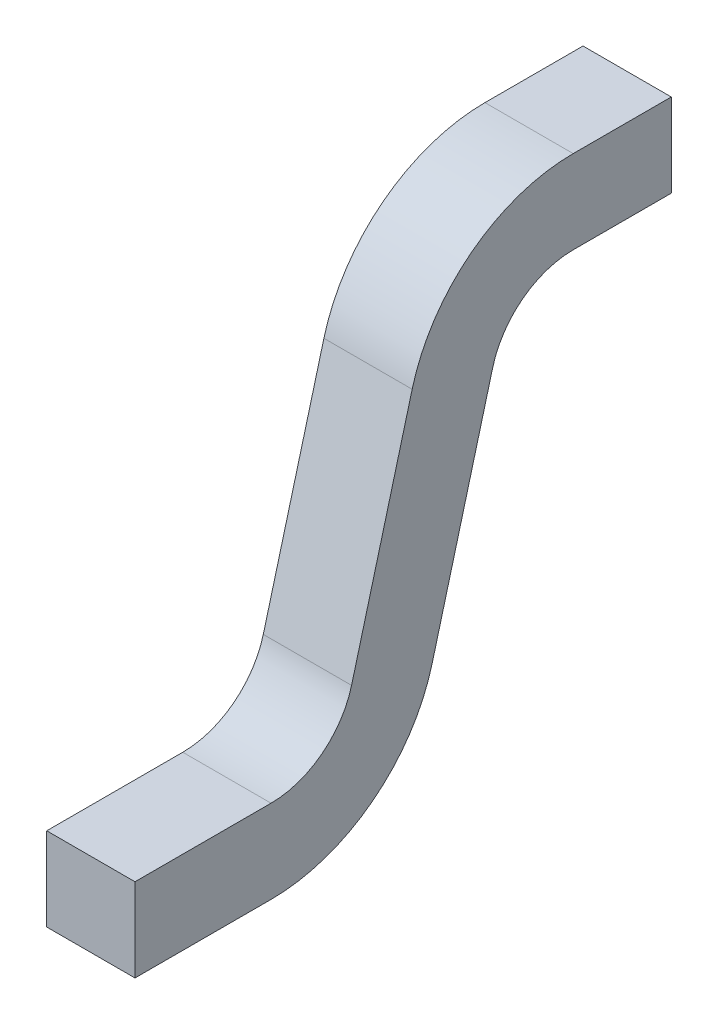
ISO-10303-21;
HEADER;
FILE_DESCRIPTION(('STEP AP214'),'2;1');
FILE_NAME('part.step','',(''),(''),'','','');
FILE_SCHEMA(('AUTOMOTIVE_DESIGN { 1 0 10303 214 1 1 1 1 }'));
ENDSEC;
DATA;
#1=APPLICATION_CONTEXT('core data for automotive mechanical design processes');
#2=APPLICATION_PROTOCOL_DEFINITION('international standard','automotive_design',2000,#1);
#3=PRODUCT_CONTEXT('',#1,'mechanical');
#4=PRODUCT('Part','Part','',(#3));
#5=PRODUCT_RELATED_PRODUCT_CATEGORY('part','',(#4));
#6=PRODUCT_DEFINITION_FORMATION('','',#4);
#7=PRODUCT_DEFINITION_CONTEXT('part definition',#1,'design');
#8=PRODUCT_DEFINITION('design','',#6,#7);
#9=PRODUCT_DEFINITION_SHAPE('','',#8);
#10=(LENGTH_UNIT() NAMED_UNIT(*) SI_UNIT(.MILLI.,.METRE.));
#11=(NAMED_UNIT(*) PLANE_ANGLE_UNIT() SI_UNIT($,.RADIAN.));
#12=(NAMED_UNIT(*) SI_UNIT($,.STERADIAN.) SOLID_ANGLE_UNIT());
#13=UNCERTAINTY_MEASURE_WITH_UNIT(LENGTH_MEASURE(1.E-05),#10,'distance_accuracy_value','');
#14=(GEOMETRIC_REPRESENTATION_CONTEXT(3) GLOBAL_UNCERTAINTY_ASSIGNED_CONTEXT((#13)) GLOBAL_UNIT_ASSIGNED_CONTEXT((#10,
#11,#12)) REPRESENTATION_CONTEXT('',''));
#15=CARTESIAN_POINT('',(0.,0.,0.));
#16=DIRECTION('',(0.,0.,1.));
#17=DIRECTION('',(1.,0.,0.));
#18=AXIS2_PLACEMENT_3D('',#15,#16,#17);
#19=CARTESIAN_POINT('',(-0.0900000000000001,-0.839203393915477,-0.306328844074898));
#20=DIRECTION('',(-1.,0.,0.));
#21=DIRECTION('',(0.,0.,1.));
#22=AXIS2_PLACEMENT_3D('',#19,#20,#21);
#23=PLANE('',#22);
#24=DIRECTION('',(0.,0.,-1.));
#25=VECTOR('',#24,1.);
#26=CARTESIAN_POINT('',(-0.0899999999999999,0.,0.7));
#27=LINE('',#26,#25);
#28=CARTESIAN_POINT('',(-0.0899999999999999,0.,0.2));
#29=VERTEX_POINT('',#28);
#30=CARTESIAN_POINT('',(-0.09,0.,0.));
#31=VERTEX_POINT('',#30);
#32=EDGE_CURVE('E130',#29,#31,#27,.T.);
#33=ORIENTED_EDGE('',*,*,#32,.F.);
#34=CARTESIAN_POINT('',(-0.0899999999999999,-0.17,0.2));
#35=DIRECTION('',(1.,0.,0.));
#36=DIRECTION('',(0.,0.,-1.));
#37=AXIS2_PLACEMENT_3D('',#34,#35,#36);
#38=CIRCLE('',#37,0.17);
#39=CARTESIAN_POINT('',(-0.0899999999999997,-0.126000762332571,0.364207390469142));
#40=VERTEX_POINT('',#39);
#41=EDGE_CURVE('E139',#29,#40,#38,.T.);
#42=ORIENTED_EDGE('',*,*,#41,.T.);
#43=DIRECTION('',(0.,0.965925826289068,-0.258819045102521));
#44=VECTOR('',#43,1.);
#45=CARTESIAN_POINT('',(-0.0899999999999996,-0.39401670399252,0.436022045595592));
#46=LINE('',#45,#44);
#47=CARTESIAN_POINT('',(-0.0899999999999995,-0.587201869250333,0.487785854616096));
#48=VERTEX_POINT('',#47);
#49=EDGE_CURVE('E136',#48,#40,#46,.T.);
#50=ORIENTED_EDGE('',*,*,#49,.F.);
#51=CARTESIAN_POINT('',(-0.0899999999999994,-0.499203393915476,0.816200635554379));
#52=DIRECTION('',(-1.,0.,0.));
#53=DIRECTION('',(0.,-1.,0.));
#54=AXIS2_PLACEMENT_3D('',#51,#52,#53);
#55=CIRCLE('',#54,0.34);
#56=CARTESIAN_POINT('',(-0.0899999999999995,-0.839203393915476,0.816200635554379));
#57=VERTEX_POINT('',#56);
#58=EDGE_CURVE('E171',#57,#48,#55,.F.);
#59=ORIENTED_EDGE('',*,*,#58,.F.);
#60=DIRECTION('',(0.,0.,-1.));
#61=VECTOR('',#60,1.);
#62=CARTESIAN_POINT('',(-0.0899999999999994,-0.839203393915477,0.393671155925102));
#63=LINE('',#62,#61);
#64=CARTESIAN_POINT('',(-0.0899999999999994,-0.839203393915476,1.0936711559251));
#65=VERTEX_POINT('',#64);
#66=EDGE_CURVE('E141',#65,#57,#63,.T.);
#67=ORIENTED_EDGE('',*,*,#66,.F.);
#68=DIRECTION('',(0.,-1.,0.));
#69=VECTOR('',#68,1.);
#70=CARTESIAN_POINT('',(-0.0899999999999994,-0.839203393915476,1.0936711559251));
#71=LINE('',#70,#69);
#72=CARTESIAN_POINT('',(-0.0899999999999994,-0.669203393915476,1.0936711559251));
#73=VERTEX_POINT('',#72);
#74=EDGE_CURVE('E147',#73,#65,#71,.T.);
#75=ORIENTED_EDGE('',*,*,#74,.F.);
#76=DIRECTION('',(0.,0.,1.));
#77=VECTOR('',#76,1.);
#78=CARTESIAN_POINT('',(-0.0899999999999995,-0.669203393915477,0.393671155925102));
#79=LINE('',#78,#77);
#80=CARTESIAN_POINT('',(-0.0899999999999995,-0.669203393915477,0.816200635554379));
#81=VERTEX_POINT('',#80);
#82=EDGE_CURVE('E100',#81,#73,#79,.T.);
#83=ORIENTED_EDGE('',*,*,#82,.F.);
#84=CARTESIAN_POINT('',(-0.0899999999999995,-0.499203393915476,0.816200635554379));
#85=DIRECTION('',(-1.,0.,0.));
#86=DIRECTION('',(0.,-1.,0.));
#87=AXIS2_PLACEMENT_3D('',#84,#85,#86);
#88=CIRCLE('',#87,0.17);
#89=CARTESIAN_POINT('',(-0.0899999999999996,-0.543202631582905,0.651993245085237));
#90=VERTEX_POINT('',#89);
#91=EDGE_CURVE('E20',#81,#90,#88,.F.);
#92=ORIENTED_EDGE('',*,*,#91,.T.);
#93=DIRECTION('',(0.,-0.965925826289068,0.258819045102521));
#94=VECTOR('',#93,1.);
#95=CARTESIAN_POINT('',(-0.0899999999999997,-0.350017466325091,0.600229436064733));
#96=LINE('',#95,#94);
#97=CARTESIAN_POINT('',(-0.0899999999999998,-0.0820015246651428,0.528414780938283));
#98=VERTEX_POINT('',#97);
#99=EDGE_CURVE('E97',#98,#90,#96,.T.);
#100=ORIENTED_EDGE('',*,*,#99,.F.);
#101=CARTESIAN_POINT('',(-0.0899999999999999,-0.17,0.2));
#102=DIRECTION('',(1.,0.,0.));
#103=DIRECTION('',(0.,0.,-1.));
#104=AXIS2_PLACEMENT_3D('',#101,#102,#103);
#105=CIRCLE('',#104,0.34);
#106=CARTESIAN_POINT('',(-0.0899999999999999,0.17,0.2));
#107=VERTEX_POINT('',#106);
#108=EDGE_CURVE('E168',#107,#98,#105,.T.);
#109=ORIENTED_EDGE('',*,*,#108,.F.);
#110=DIRECTION('',(0.,0.,1.));
#111=VECTOR('',#110,1.);
#112=CARTESIAN_POINT('',(-0.09,0.17,0.7));
#113=LINE('',#112,#111);
#114=CARTESIAN_POINT('',(-0.09,0.17,0.));
#115=VERTEX_POINT('',#114);
#116=EDGE_CURVE('E119',#115,#107,#113,.T.);
#117=ORIENTED_EDGE('',*,*,#116,.F.);
#118=DIRECTION('',(0.,1.,0.));
#119=VECTOR('',#118,1.);
#120=CARTESIAN_POINT('',(-0.09,0.,0.));
#121=LINE('',#120,#119);
#122=EDGE_CURVE('E124',#31,#115,#121,.T.);
#123=ORIENTED_EDGE('',*,*,#122,.F.);
#124=EDGE_LOOP('',(#33,#42,#50,#59,#67,#75,#83,#92,#100,#109,#117,#123));
#125=FACE_BOUND('',#124,.T.);
#126=ADVANCED_FACE('F17',(#125),#23,.T.);
#127=CARTESIAN_POINT('',(0.,-0.350017466325091,0.600229436064733));
#128=DIRECTION('',(0.,0.258819045102521,0.965925826289068));
#129=DIRECTION('',(0.,-0.965925826289068,0.258819045102521));
#130=AXIS2_PLACEMENT_3D('',#127,#128,#129);
#131=PLANE('',#130);
#132=DIRECTION('',(-1.,0.,0.));
#133=VECTOR('',#132,1.);
#134=CARTESIAN_POINT('',(-0.267707469156736,-0.543202631582905,0.651993245085238));
#135=LINE('',#134,#133);
#136=CARTESIAN_POINT('',(0.0900000000000002,-0.543202631582905,0.651993245085238));
#137=VERTEX_POINT('',#136);
#138=EDGE_CURVE('E102',#90,#137,#135,.F.);
#139=ORIENTED_EDGE('',*,*,#138,.T.);
#140=DIRECTION('',(0.,-0.965925826289068,0.258819045102522));
#141=VECTOR('',#140,1.);
#142=CARTESIAN_POINT('',(0.0900000000000002,-0.0820015246651429,0.528414780938283));
#143=LINE('',#142,#141);
#144=CARTESIAN_POINT('',(0.0900000000000001,-0.0820015246651426,0.528414780938283));
#145=VERTEX_POINT('',#144);
#146=EDGE_CURVE('E167',#145,#137,#143,.T.);
#147=ORIENTED_EDGE('',*,*,#146,.F.);
#148=DIRECTION('',(1.,0.,0.));
#149=VECTOR('',#148,1.);
#150=CARTESIAN_POINT('',(0.194661618624334,-0.0820015246651427,0.528414780938283));
#151=LINE('',#150,#149);
#152=EDGE_CURVE('E107',#98,#145,#151,.T.);
#153=ORIENTED_EDGE('',*,*,#152,.F.);
#154=ORIENTED_EDGE('',*,*,#99,.T.);
#155=EDGE_LOOP('',(#139,#147,#153,#154));
#156=FACE_BOUND('',#155,.T.);
#157=ADVANCED_FACE('F104',(#156),#131,.T.);
#158=CARTESIAN_POINT('',(-0.267707469156736,-0.499203393915476,0.816200635554379));
#159=DIRECTION('',(-1.,0.,0.));
#160=DIRECTION('',(0.,-1.,0.));
#161=AXIS2_PLACEMENT_3D('',#158,#159,#160);
#162=CYLINDRICAL_SURFACE('',#161,0.17);
#163=CARTESIAN_POINT('',(0.0900000000000002,-0.499203393915476,0.816200635554379));
#164=DIRECTION('',(-1.,0.,0.));
#165=DIRECTION('',(0.,-1.,0.));
#166=AXIS2_PLACEMENT_3D('',#163,#164,#165);
#167=CIRCLE('',#166,0.17);
#168=CARTESIAN_POINT('',(0.0900000000000002,-0.669203393915476,0.816200635554379));
#169=VERTEX_POINT('',#168);
#170=EDGE_CURVE('E112',#137,#169,#167,.T.);
#171=ORIENTED_EDGE('',*,*,#170,.F.);
#172=ORIENTED_EDGE('',*,*,#138,.F.);
#173=ORIENTED_EDGE('',*,*,#91,.F.);
#174=DIRECTION('',(1.,0.,0.));
#175=VECTOR('',#174,1.);
#176=CARTESIAN_POINT('',(0.,-0.669203393915477,0.816200635554379));
#177=LINE('',#176,#175);
#178=EDGE_CURVE('E114',#169,#81,#177,.F.);
#179=ORIENTED_EDGE('',*,*,#178,.F.);
#180=EDGE_LOOP('',(#171,#172,#173,#179));
#181=FACE_BOUND('',#180,.T.);
#182=ADVANCED_FACE('F110',(#181),#162,.F.);
#183=CARTESIAN_POINT('',(0.,-0.669203393915477,0.393671155925102));
#184=DIRECTION('',(0.,1.,0.));
#185=DIRECTION('',(0.,0.,1.));
#186=AXIS2_PLACEMENT_3D('',#183,#184,#185);
#187=PLANE('',#186);
#188=DIRECTION('',(1.,0.,0.));
#189=VECTOR('',#188,1.);
#190=CARTESIAN_POINT('',(-0.0899999999999994,-0.669203393915476,1.0936711559251));
#191=LINE('',#190,#189);
#192=CARTESIAN_POINT('',(0.0900000000000003,-0.669203393915476,1.0936711559251));
#193=VERTEX_POINT('',#192);
#194=EDGE_CURVE('E150',#193,#73,#191,.F.);
#195=ORIENTED_EDGE('',*,*,#194,.F.);
#196=DIRECTION('',(0.,0.,-1.));
#197=VECTOR('',#196,1.);
#198=CARTESIAN_POINT('',(0.0900000000000003,-0.669203393915476,1.0936711559251));
#199=LINE('',#198,#197);
#200=EDGE_CURVE('E166',#169,#193,#199,.F.);
#201=ORIENTED_EDGE('',*,*,#200,.F.);
#202=ORIENTED_EDGE('',*,*,#178,.T.);
#203=ORIENTED_EDGE('',*,*,#82,.T.);
#204=EDGE_LOOP('',(#195,#201,#202,#203));
#205=FACE_BOUND('',#204,.T.);
#206=ADVANCED_FACE('F202',(#205),#187,.T.);
#207=CARTESIAN_POINT('',(-0.0899999999999994,-0.839203393915476,1.0936711559251));
#208=DIRECTION('',(0.,0.,1.));
#209=DIRECTION('',(0.,-1.,0.));
#210=AXIS2_PLACEMENT_3D('',#207,#208,#209);
#211=PLANE('',#210);
#212=ORIENTED_EDGE('',*,*,#194,.T.);
#213=ORIENTED_EDGE('',*,*,#74,.T.);
#214=DIRECTION('',(1.,0.,0.));
#215=VECTOR('',#214,1.);
#216=CARTESIAN_POINT('',(0.,-0.839203393915477,1.0936711559251));
#217=LINE('',#216,#215);
#218=CARTESIAN_POINT('',(0.0900000000000003,-0.839203393915476,1.0936711559251));
#219=VERTEX_POINT('',#218);
#220=EDGE_CURVE('E144',#219,#65,#217,.F.);
#221=ORIENTED_EDGE('',*,*,#220,.F.);
#222=DIRECTION('',(0.,1.,0.));
#223=VECTOR('',#222,1.);
#224=CARTESIAN_POINT('',(0.0900000000000003,-0.839203393915476,1.0936711559251));
#225=LINE('',#224,#223);
#226=EDGE_CURVE('E186',#193,#219,#225,.F.);
#227=ORIENTED_EDGE('',*,*,#226,.F.);
#228=EDGE_LOOP('',(#212,#213,#221,#227));
#229=FACE_BOUND('',#228,.T.);
#230=ADVANCED_FACE('F196',(#229),#211,.T.);
#231=CARTESIAN_POINT('',(0.,-0.839203393915477,0.393671155925102));
#232=DIRECTION('',(0.,-1.,0.));
#233=DIRECTION('',(0.,0.,-1.));
#234=AXIS2_PLACEMENT_3D('',#231,#232,#233);
#235=PLANE('',#234);
#236=ORIENTED_EDGE('',*,*,#220,.T.);
#237=ORIENTED_EDGE('',*,*,#66,.T.);
#238=DIRECTION('',(-1.,0.,0.));
#239=VECTOR('',#238,1.);
#240=CARTESIAN_POINT('',(-0.267707469156736,-0.839203393915476,0.816200635554379));
#241=LINE('',#240,#239);
#242=CARTESIAN_POINT('',(0.0900000000000002,-0.839203393915476,0.816200635554379));
#243=VERTEX_POINT('',#242);
#244=EDGE_CURVE('E143',#243,#57,#241,.T.);
#245=ORIENTED_EDGE('',*,*,#244,.F.);
#246=DIRECTION('',(0.,0.,-1.));
#247=VECTOR('',#246,1.);
#248=CARTESIAN_POINT('',(0.0900000000000003,-0.839203393915476,1.0936711559251));
#249=LINE('',#248,#247);
#250=EDGE_CURVE('E164',#219,#243,#249,.T.);
#251=ORIENTED_EDGE('',*,*,#250,.F.);
#252=EDGE_LOOP('',(#236,#237,#245,#251));
#253=FACE_BOUND('',#252,.T.);
#254=ADVANCED_FACE('F267',(#253),#235,.T.);
#255=CARTESIAN_POINT('',(-0.267707469156736,-0.499203393915476,0.816200635554379));
#256=DIRECTION('',(-1.,0.,0.));
#257=DIRECTION('',(0.,-1.,0.));
#258=AXIS2_PLACEMENT_3D('',#255,#256,#257);
#259=CYLINDRICAL_SURFACE('',#258,0.34);
#260=DIRECTION('',(1.,0.,0.));
#261=VECTOR('',#260,1.);
#262=CARTESIAN_POINT('',(0.,-0.587201869250334,0.487785854616096));
#263=LINE('',#262,#261);
#264=CARTESIAN_POINT('',(0.0900000000000001,-0.587201869250333,0.487785854616096));
#265=VERTEX_POINT('',#264);
#266=EDGE_CURVE('E140',#265,#48,#263,.F.);
#267=ORIENTED_EDGE('',*,*,#266,.F.);
#268=CARTESIAN_POINT('',(0.0900000000000002,-0.499203393915476,0.816200635554379));
#269=DIRECTION('',(-1.,0.,0.));
#270=DIRECTION('',(0.,-1.,0.));
#271=AXIS2_PLACEMENT_3D('',#268,#269,#270);
#272=CIRCLE('',#271,0.34);
#273=EDGE_CURVE('E161',#243,#265,#272,.F.);
#274=ORIENTED_EDGE('',*,*,#273,.F.);
#275=ORIENTED_EDGE('',*,*,#244,.T.);
#276=ORIENTED_EDGE('',*,*,#58,.T.);
#277=EDGE_LOOP('',(#267,#274,#275,#276));
#278=FACE_BOUND('',#277,.T.);
#279=ADVANCED_FACE('F264',(#278),#259,.T.);
#280=CARTESIAN_POINT('',(0.,-0.39401670399252,0.436022045595592));
#281=DIRECTION('',(0.,-0.258819045102521,-0.965925826289068));
#282=DIRECTION('',(0.,0.965925826289068,-0.258819045102521));
#283=AXIS2_PLACEMENT_3D('',#280,#281,#282);
#284=PLANE('',#283);
#285=ORIENTED_EDGE('',*,*,#266,.T.);
#286=ORIENTED_EDGE('',*,*,#49,.T.);
#287=DIRECTION('',(1.,0.,0.));
#288=VECTOR('',#287,1.);
#289=CARTESIAN_POINT('',(0.194661618624334,-0.126000762332571,0.364207390469142));
#290=LINE('',#289,#288);
#291=CARTESIAN_POINT('',(0.0900000000000001,-0.126000762332571,0.364207390469142));
#292=VERTEX_POINT('',#291);
#293=EDGE_CURVE('E170',#40,#292,#290,.T.);
#294=ORIENTED_EDGE('',*,*,#293,.T.);
#295=DIRECTION('',(0.,0.965925826289068,-0.25881904510252));
#296=VECTOR('',#295,1.);
#297=CARTESIAN_POINT('',(0.0900000000000001,-0.587201869250334,0.487785854616096));
#298=LINE('',#297,#296);
#299=EDGE_CURVE('E160',#265,#292,#298,.T.);
#300=ORIENTED_EDGE('',*,*,#299,.F.);
#301=EDGE_LOOP('',(#285,#286,#294,#300));
#302=FACE_BOUND('',#301,.T.);
#303=ADVANCED_FACE('F237',(#302),#284,.T.);
#304=CARTESIAN_POINT('',(0.194661618624334,-0.17,0.2));
#305=DIRECTION('',(1.,0.,0.));
#306=DIRECTION('',(0.,0.,-1.));
#307=AXIS2_PLACEMENT_3D('',#304,#305,#306);
#308=CYLINDRICAL_SURFACE('',#307,0.17);
#309=ORIENTED_EDGE('',*,*,#41,.F.);
#310=DIRECTION('',(1.,0.,0.));
#311=VECTOR('',#310,1.);
#312=CARTESIAN_POINT('',(0.,0.,0.2));
#313=LINE('',#312,#311);
#314=CARTESIAN_POINT('',(0.0900000000000001,0.,0.2));
#315=VERTEX_POINT('',#314);
#316=EDGE_CURVE('E133',#315,#29,#313,.F.);
#317=ORIENTED_EDGE('',*,*,#316,.F.);
#318=CARTESIAN_POINT('',(0.0900000000000001,-0.17,0.2));
#319=DIRECTION('',(1.,0.,0.));
#320=DIRECTION('',(0.,0.,-1.));
#321=AXIS2_PLACEMENT_3D('',#318,#319,#320);
#322=CIRCLE('',#321,0.17);
#323=EDGE_CURVE('E156',#292,#315,#322,.F.);
#324=ORIENTED_EDGE('',*,*,#323,.F.);
#325=ORIENTED_EDGE('',*,*,#293,.F.);
#326=EDGE_LOOP('',(#309,#317,#324,#325));
#327=FACE_BOUND('',#326,.T.);
#328=ADVANCED_FACE('F240',(#327),#308,.F.);
#329=CARTESIAN_POINT('',(0.,0.,0.7));
#330=DIRECTION('',(0.,-1.,0.));
#331=DIRECTION('',(0.,0.,-1.));
#332=AXIS2_PLACEMENT_3D('',#329,#330,#331);
#333=PLANE('',#332);
#334=DIRECTION('',(-1.,0.,0.));
#335=VECTOR('',#334,1.);
#336=CARTESIAN_POINT('',(0.09,0.,0.));
#337=LINE('',#336,#335);
#338=CARTESIAN_POINT('',(0.0900000000000001,0.,0.));
#339=VERTEX_POINT('',#338);
#340=EDGE_CURVE('E127',#339,#31,#337,.T.);
#341=ORIENTED_EDGE('',*,*,#340,.F.);
#342=DIRECTION('',(0.,0.,-1.));
#343=VECTOR('',#342,1.);
#344=CARTESIAN_POINT('',(0.0900000000000004,0.,1.0936711559251));
#345=LINE('',#344,#343);
#346=EDGE_CURVE('E159',#315,#339,#345,.T.);
#347=ORIENTED_EDGE('',*,*,#346,.F.);
#348=ORIENTED_EDGE('',*,*,#316,.T.);
#349=ORIENTED_EDGE('',*,*,#32,.T.);
#350=EDGE_LOOP('',(#341,#347,#348,#349));
#351=FACE_BOUND('',#350,.T.);
#352=ADVANCED_FACE('F263',(#351),#333,.T.);
#353=CARTESIAN_POINT('',(0.09,0.,0.));
#354=DIRECTION('',(0.,0.,-1.));
#355=DIRECTION('',(-1.,0.,0.));
#356=AXIS2_PLACEMENT_3D('',#353,#354,#355);
#357=PLANE('',#356);
#358=DIRECTION('',(1.,0.,0.));
#359=VECTOR('',#358,1.);
#360=CARTESIAN_POINT('',(0.,0.17,0.));
#361=LINE('',#360,#359);
#362=CARTESIAN_POINT('',(0.0900000000000001,0.17,0.));
#363=VERTEX_POINT('',#362);
#364=EDGE_CURVE('E121',#363,#115,#361,.F.);
#365=ORIENTED_EDGE('',*,*,#364,.F.);
#366=DIRECTION('',(0.,1.,0.));
#367=VECTOR('',#366,1.);
#368=CARTESIAN_POINT('',(0.09,-0.839203393915476,0.));
#369=LINE('',#368,#367);
#370=EDGE_CURVE('E225',#339,#363,#369,.T.);
#371=ORIENTED_EDGE('',*,*,#370,.F.);
#372=ORIENTED_EDGE('',*,*,#340,.T.);
#373=ORIENTED_EDGE('',*,*,#122,.T.);
#374=EDGE_LOOP('',(#365,#371,#372,#373));
#375=FACE_BOUND('',#374,.T.);
#376=ADVANCED_FACE('F213',(#375),#357,.T.);
#377=CARTESIAN_POINT('',(0.,0.17,0.7));
#378=DIRECTION('',(0.,1.,0.));
#379=DIRECTION('',(0.,0.,1.));
#380=AXIS2_PLACEMENT_3D('',#377,#378,#379);
#381=PLANE('',#380);
#382=ORIENTED_EDGE('',*,*,#364,.T.);
#383=ORIENTED_EDGE('',*,*,#116,.T.);
#384=DIRECTION('',(1.,0.,0.));
#385=VECTOR('',#384,1.);
#386=CARTESIAN_POINT('',(0.194661618624334,0.17,0.2));
#387=LINE('',#386,#385);
#388=CARTESIAN_POINT('',(0.0900000000000001,0.17,0.2));
#389=VERTEX_POINT('',#388);
#390=EDGE_CURVE('E35',#389,#107,#387,.F.);
#391=ORIENTED_EDGE('',*,*,#390,.F.);
#392=DIRECTION('',(0.,0.,-1.));
#393=VECTOR('',#392,1.);
#394=CARTESIAN_POINT('',(0.0900000000000004,0.17,1.0936711559251));
#395=LINE('',#394,#393);
#396=EDGE_CURVE('E26',#363,#389,#395,.F.);
#397=ORIENTED_EDGE('',*,*,#396,.F.);
#398=EDGE_LOOP('',(#382,#383,#391,#397));
#399=FACE_BOUND('',#398,.T.);
#400=ADVANCED_FACE('F216',(#399),#381,.T.);
#401=CARTESIAN_POINT('',(0.194661618624334,-0.17,0.2));
#402=DIRECTION('',(1.,0.,0.));
#403=DIRECTION('',(0.,0.,-1.));
#404=AXIS2_PLACEMENT_3D('',#401,#402,#403);
#405=CYLINDRICAL_SURFACE('',#404,0.34);
#406=ORIENTED_EDGE('',*,*,#390,.T.);
#407=ORIENTED_EDGE('',*,*,#108,.T.);
#408=ORIENTED_EDGE('',*,*,#152,.T.);
#409=CARTESIAN_POINT('',(0.0900000000000001,-0.17,0.2));
#410=DIRECTION('',(1.,0.,0.));
#411=DIRECTION('',(0.,0.,-1.));
#412=AXIS2_PLACEMENT_3D('',#409,#410,#411);
#413=CIRCLE('',#412,0.34);
#414=EDGE_CURVE('E11',#389,#145,#413,.T.);
#415=ORIENTED_EDGE('',*,*,#414,.F.);
#416=EDGE_LOOP('',(#406,#407,#408,#415));
#417=FACE_BOUND('',#416,.T.);
#418=ADVANCED_FACE('F258',(#417),#405,.T.);
#419=CARTESIAN_POINT('',(0.0900000000000003,-0.839203393915476,1.0936711559251));
#420=DIRECTION('',(1.,0.,0.));
#421=DIRECTION('',(0.,0.,-1.));
#422=AXIS2_PLACEMENT_3D('',#419,#420,#421);
#423=PLANE('',#422);
#424=ORIENTED_EDGE('',*,*,#396,.T.);
#425=ORIENTED_EDGE('',*,*,#414,.T.);
#426=ORIENTED_EDGE('',*,*,#146,.T.);
#427=ORIENTED_EDGE('',*,*,#170,.T.);
#428=ORIENTED_EDGE('',*,*,#200,.T.);
#429=ORIENTED_EDGE('',*,*,#226,.T.);
#430=ORIENTED_EDGE('',*,*,#250,.T.);
#431=ORIENTED_EDGE('',*,*,#273,.T.);
#432=ORIENTED_EDGE('',*,*,#299,.T.);
#433=ORIENTED_EDGE('',*,*,#323,.T.);
#434=ORIENTED_EDGE('',*,*,#346,.T.);
#435=ORIENTED_EDGE('',*,*,#370,.T.);
#436=EDGE_LOOP('',(#424,#425,#426,#427,#428,#429,#430,#431,#432,#433,#434,#435));
#437=FACE_BOUND('',#436,.T.);
#438=ADVANCED_FACE('F244',(#437),#423,.T.);
#439=CLOSED_SHELL('',(#126,#157,#182,#206,#230,#254,#279,#303,#328,#352,#376,#400,#418,#438));
#440=MANIFOLD_SOLID_BREP('B1',#439);
#441=ADVANCED_BREP_SHAPE_REPRESENTATION('',(#18,#440),#14);
#442=SHAPE_DEFINITION_REPRESENTATION(#9,#441);
ENDSEC;
END-ISO-10303-21;
